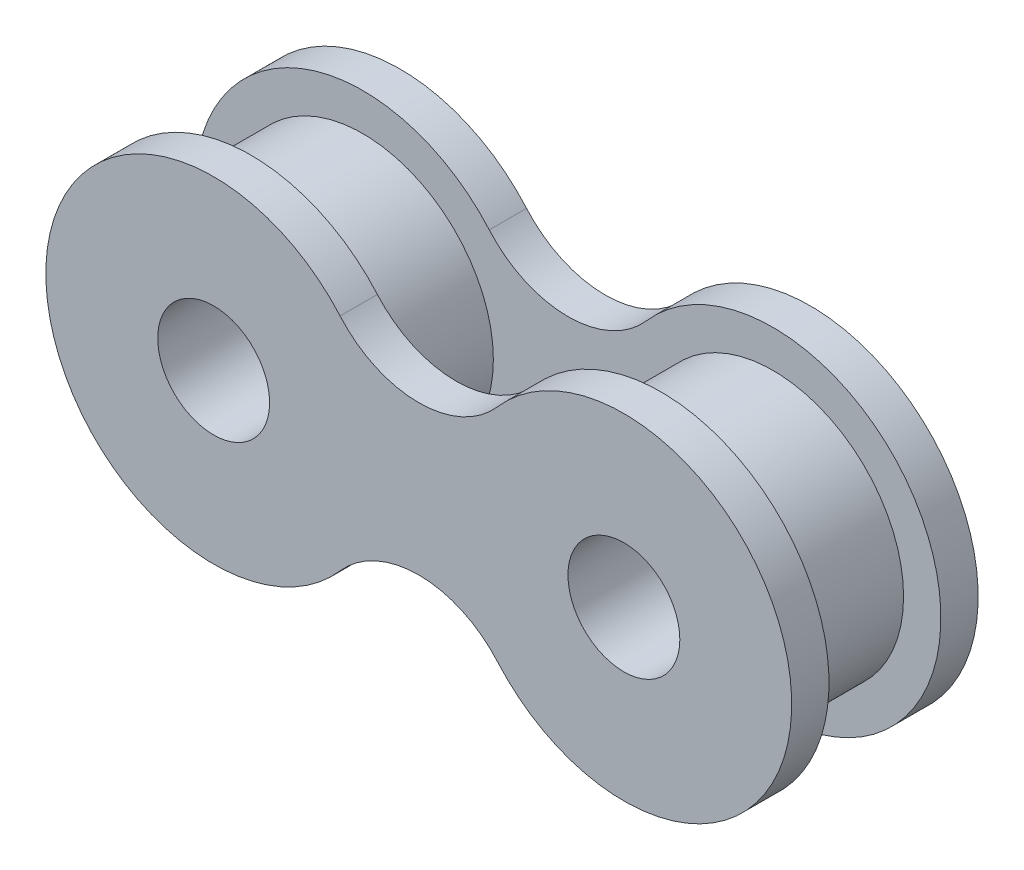
ISO-10303-21;
HEADER;
FILE_DESCRIPTION(('STEP AP214'),'2;1');
FILE_NAME('part.step','',(''),(''),'','','');
FILE_SCHEMA(('AUTOMOTIVE_DESIGN { 1 0 10303 214 1 1 1 1 }'));
ENDSEC;
DATA;
#1=APPLICATION_CONTEXT('core data for automotive mechanical design processes');
#2=APPLICATION_PROTOCOL_DEFINITION('international standard','automotive_design',2000,#1);
#3=PRODUCT_CONTEXT('',#1,'mechanical');
#4=PRODUCT('Part','Part','',(#3));
#5=PRODUCT_RELATED_PRODUCT_CATEGORY('part','',(#4));
#6=PRODUCT_DEFINITION_FORMATION('','',#4);
#7=PRODUCT_DEFINITION_CONTEXT('part definition',#1,'design');
#8=PRODUCT_DEFINITION('design','',#6,#7);
#9=PRODUCT_DEFINITION_SHAPE('','',#8);
#10=(LENGTH_UNIT() NAMED_UNIT(*) SI_UNIT(.MILLI.,.METRE.));
#11=(NAMED_UNIT(*) PLANE_ANGLE_UNIT() SI_UNIT($,.RADIAN.));
#12=(NAMED_UNIT(*) SI_UNIT($,.STERADIAN.) SOLID_ANGLE_UNIT());
#13=UNCERTAINTY_MEASURE_WITH_UNIT(LENGTH_MEASURE(1.E-05),#10,'distance_accuracy_value','');
#14=(GEOMETRIC_REPRESENTATION_CONTEXT(3) GLOBAL_UNCERTAINTY_ASSIGNED_CONTEXT((#13)) GLOBAL_UNIT_ASSIGNED_CONTEXT((#10,
#11,#12)) REPRESENTATION_CONTEXT('',''));
#15=CARTESIAN_POINT('',(0.,0.,0.));
#16=DIRECTION('',(0.,0.,1.));
#17=DIRECTION('',(1.,0.,0.));
#18=AXIS2_PLACEMENT_3D('',#15,#16,#17);
#19=CARTESIAN_POINT('',(2.75,2.4,1.));
#20=DIRECTION('',(0.,0.,1.));
#21=DIRECTION('',(1.,0.,0.));
#22=AXIS2_PLACEMENT_3D('',#19,#20,#21);
#23=PLANE('',#22);
#24=CARTESIAN_POINT('',(0.,4.8,1.));
#25=DIRECTION('',(0.,0.,-1.));
#26=DIRECTION('',(1.,0.,0.));
#27=AXIS2_PLACEMENT_3D('',#24,#25,#26);
#28=CIRCLE('',#27,2.8);
#29=CARTESIAN_POINT('',(2.10958904109589,2.95890410958904,1.));
#30=VERTEX_POINT('',#29);
#31=CARTESIAN_POINT('',(-2.10958904109589,2.95890410958904,1.));
#32=VERTEX_POINT('',#31);
#33=EDGE_CURVE('E175',#30,#32,#28,.T.);
#34=ORIENTED_EDGE('',*,*,#33,.T.);
#35=CARTESIAN_POINT('',(-5.5,0.,1.));
#36=DIRECTION('',(0.,0.,1.));
#37=DIRECTION('',(-1.,0.,0.));
#38=AXIS2_PLACEMENT_3D('',#35,#36,#37);
#39=CIRCLE('',#38,4.5);
#40=CARTESIAN_POINT('',(-2.10958904109589,-2.95890410958904,1.));
#41=VERTEX_POINT('',#40);
#42=EDGE_CURVE('E92',#32,#41,#39,.T.);
#43=ORIENTED_EDGE('',*,*,#42,.T.);
#44=CARTESIAN_POINT('',(0.,-4.8,1.));
#45=DIRECTION('',(0.,0.,-1.));
#46=DIRECTION('',(-1.,0.,0.));
#47=AXIS2_PLACEMENT_3D('',#44,#45,#46);
#48=CIRCLE('',#47,2.8);
#49=CARTESIAN_POINT('',(2.10958904109589,-2.95890410958904,1.));
#50=VERTEX_POINT('',#49);
#51=EDGE_CURVE('E180',#41,#50,#48,.T.);
#52=ORIENTED_EDGE('',*,*,#51,.T.);
#53=CARTESIAN_POINT('',(5.5,0.,1.));
#54=DIRECTION('',(0.,0.,1.));
#55=DIRECTION('',(1.,0.,0.));
#56=AXIS2_PLACEMENT_3D('',#53,#54,#55);
#57=CIRCLE('',#56,4.5);
#58=EDGE_CURVE('E60',#50,#30,#57,.T.);
#59=ORIENTED_EDGE('',*,*,#58,.T.);
#60=EDGE_LOOP('',(#34,#43,#52,#59));
#61=FACE_BOUND('',#60,.T.);
#62=CARTESIAN_POINT('',(-5.5,0.,1.));
#63=DIRECTION('',(0.,0.,1.));
#64=DIRECTION('',(1.,0.,0.));
#65=AXIS2_PLACEMENT_3D('',#62,#63,#64);
#66=CIRCLE('',#65,3.5);
#67=CARTESIAN_POINT('',(-2.,0.,1.));
#68=VERTEX_POINT('',#67);
#69=EDGE_CURVE('E11',#68,#68,#66,.T.);
#70=ORIENTED_EDGE('',*,*,#69,.F.);
#71=EDGE_LOOP('',(#70));
#72=FACE_BOUND('',#71,.T.);
#73=CARTESIAN_POINT('',(5.5,0.,1.));
#74=DIRECTION('',(0.,0.,1.));
#75=DIRECTION('',(1.,0.,0.));
#76=AXIS2_PLACEMENT_3D('',#73,#74,#75);
#77=CIRCLE('',#76,3.5);
#78=CARTESIAN_POINT('',(9.,0.,1.));
#79=VERTEX_POINT('',#78);
#80=EDGE_CURVE('E148',#79,#79,#77,.T.);
#81=ORIENTED_EDGE('',*,*,#80,.F.);
#82=EDGE_LOOP('',(#81));
#83=FACE_BOUND('',#82,.T.);
#84=ADVANCED_FACE('F41',(#61,#72,#83),#23,.T.);
#85=CARTESIAN_POINT('',(2.75,2.4,0.));
#86=DIRECTION('',(0.,0.,1.));
#87=DIRECTION('',(1.,0.,0.));
#88=AXIS2_PLACEMENT_3D('',#85,#86,#87);
#89=PLANE('',#88);
#90=CARTESIAN_POINT('',(0.,4.8,0.));
#91=DIRECTION('',(0.,0.,-1.));
#92=DIRECTION('',(1.,0.,0.));
#93=AXIS2_PLACEMENT_3D('',#90,#91,#92);
#94=CIRCLE('',#93,2.8);
#95=CARTESIAN_POINT('',(2.10958904109589,2.95890410958904,0.));
#96=VERTEX_POINT('',#95);
#97=CARTESIAN_POINT('',(-2.10958904109589,2.95890410958904,0.));
#98=VERTEX_POINT('',#97);
#99=EDGE_CURVE('E174',#96,#98,#94,.T.);
#100=ORIENTED_EDGE('',*,*,#99,.F.);
#101=CARTESIAN_POINT('',(5.5,0.,0.));
#102=DIRECTION('',(0.,0.,1.));
#103=DIRECTION('',(1.,0.,0.));
#104=AXIS2_PLACEMENT_3D('',#101,#102,#103);
#105=CIRCLE('',#104,4.5);
#106=CARTESIAN_POINT('',(2.10958904109589,-2.95890410958904,0.));
#107=VERTEX_POINT('',#106);
#108=EDGE_CURVE('E84',#107,#96,#105,.T.);
#109=ORIENTED_EDGE('',*,*,#108,.F.);
#110=CARTESIAN_POINT('',(0.,-4.8,0.));
#111=DIRECTION('',(0.,0.,-1.));
#112=DIRECTION('',(-1.,0.,0.));
#113=AXIS2_PLACEMENT_3D('',#110,#111,#112);
#114=CIRCLE('',#113,2.8);
#115=CARTESIAN_POINT('',(-2.10958904109589,-2.95890410958904,0.));
#116=VERTEX_POINT('',#115);
#117=EDGE_CURVE('E78',#116,#107,#114,.T.);
#118=ORIENTED_EDGE('',*,*,#117,.F.);
#119=CARTESIAN_POINT('',(-5.5,0.,0.));
#120=DIRECTION('',(0.,0.,1.));
#121=DIRECTION('',(-1.,0.,0.));
#122=AXIS2_PLACEMENT_3D('',#119,#120,#121);
#123=CIRCLE('',#122,4.5);
#124=EDGE_CURVE('E189',#98,#116,#123,.T.);
#125=ORIENTED_EDGE('',*,*,#124,.F.);
#126=EDGE_LOOP('',(#100,#109,#118,#125));
#127=FACE_BOUND('',#126,.T.);
#128=CARTESIAN_POINT('',(-5.5,0.,0.));
#129=DIRECTION('',(0.,0.,1.));
#130=DIRECTION('',(1.,0.,0.));
#131=AXIS2_PLACEMENT_3D('',#128,#129,#130);
#132=CIRCLE('',#131,1.5);
#133=CARTESIAN_POINT('',(-4.,0.,0.));
#134=VERTEX_POINT('',#133);
#135=EDGE_CURVE('E170',#134,#134,#132,.T.);
#136=ORIENTED_EDGE('',*,*,#135,.T.);
#137=EDGE_LOOP('',(#136));
#138=FACE_BOUND('',#137,.T.);
#139=CARTESIAN_POINT('',(5.5,0.,0.));
#140=DIRECTION('',(0.,0.,1.));
#141=DIRECTION('',(-1.,0.,0.));
#142=AXIS2_PLACEMENT_3D('',#139,#140,#141);
#143=CIRCLE('',#142,1.5);
#144=CARTESIAN_POINT('',(4.,0.,0.));
#145=VERTEX_POINT('',#144);
#146=EDGE_CURVE('E165',#145,#145,#143,.T.);
#147=ORIENTED_EDGE('',*,*,#146,.T.);
#148=EDGE_LOOP('',(#147));
#149=FACE_BOUND('',#148,.T.);
#150=ADVANCED_FACE('F210',(#127,#138,#149),#89,.F.);
#151=CARTESIAN_POINT('',(0.,4.8,1.));
#152=DIRECTION('',(0.,0.,-1.));
#153=DIRECTION('',(-1.,0.,0.));
#154=AXIS2_PLACEMENT_3D('',#151,#152,#153);
#155=CYLINDRICAL_SURFACE('',#154,2.8);
#156=ORIENTED_EDGE('',*,*,#99,.T.);
#157=DIRECTION('',(0.,0.,-1.));
#158=VECTOR('',#157,1.);
#159=CARTESIAN_POINT('',(-2.10958904109589,2.95890410958904,1.));
#160=LINE('',#159,#158);
#161=EDGE_CURVE('E45',#32,#98,#160,.T.);
#162=ORIENTED_EDGE('',*,*,#161,.F.);
#163=ORIENTED_EDGE('',*,*,#33,.F.);
#164=DIRECTION('',(0.,0.,-1.));
#165=VECTOR('',#164,1.);
#166=CARTESIAN_POINT('',(2.10958904109589,2.95890410958904,1.));
#167=LINE('',#166,#165);
#168=EDGE_CURVE('E185',#30,#96,#167,.T.);
#169=ORIENTED_EDGE('',*,*,#168,.T.);
#170=EDGE_LOOP('',(#156,#162,#163,#169));
#171=FACE_BOUND('',#170,.T.);
#172=ADVANCED_FACE('F43',(#171),#155,.F.);
#173=CARTESIAN_POINT('',(-5.5,0.,1.));
#174=DIRECTION('',(0.,0.,-1.));
#175=DIRECTION('',(-1.,0.,0.));
#176=AXIS2_PLACEMENT_3D('',#173,#174,#175);
#177=CYLINDRICAL_SURFACE('',#176,4.5);
#178=ORIENTED_EDGE('',*,*,#124,.T.);
#179=DIRECTION('',(0.,0.,-1.));
#180=VECTOR('',#179,1.);
#181=CARTESIAN_POINT('',(-2.10958904109589,-2.95890410958904,1.));
#182=LINE('',#181,#180);
#183=EDGE_CURVE('E200',#41,#116,#182,.T.);
#184=ORIENTED_EDGE('',*,*,#183,.F.);
#185=ORIENTED_EDGE('',*,*,#42,.F.);
#186=ORIENTED_EDGE('',*,*,#161,.T.);
#187=EDGE_LOOP('',(#178,#184,#185,#186));
#188=FACE_BOUND('',#187,.T.);
#189=ADVANCED_FACE('F205',(#188),#177,.T.);
#190=CARTESIAN_POINT('',(0.,-4.8,1.));
#191=DIRECTION('',(0.,0.,-1.));
#192=DIRECTION('',(-1.,0.,0.));
#193=AXIS2_PLACEMENT_3D('',#190,#191,#192);
#194=CYLINDRICAL_SURFACE('',#193,2.8);
#195=ORIENTED_EDGE('',*,*,#117,.T.);
#196=DIRECTION('',(0.,0.,-1.));
#197=VECTOR('',#196,1.);
#198=CARTESIAN_POINT('',(2.10958904109589,-2.95890410958904,1.));
#199=LINE('',#198,#197);
#200=EDGE_CURVE('E198',#50,#107,#199,.T.);
#201=ORIENTED_EDGE('',*,*,#200,.F.);
#202=ORIENTED_EDGE('',*,*,#51,.F.);
#203=ORIENTED_EDGE('',*,*,#183,.T.);
#204=EDGE_LOOP('',(#195,#201,#202,#203));
#205=FACE_BOUND('',#204,.T.);
#206=ADVANCED_FACE('F279',(#205),#194,.F.);
#207=CARTESIAN_POINT('',(5.5,0.,1.));
#208=DIRECTION('',(0.,0.,-1.));
#209=DIRECTION('',(-1.,0.,0.));
#210=AXIS2_PLACEMENT_3D('',#207,#208,#209);
#211=CYLINDRICAL_SURFACE('',#210,4.5);
#212=ORIENTED_EDGE('',*,*,#108,.T.);
#213=ORIENTED_EDGE('',*,*,#168,.F.);
#214=ORIENTED_EDGE('',*,*,#58,.F.);
#215=ORIENTED_EDGE('',*,*,#200,.T.);
#216=EDGE_LOOP('',(#212,#213,#214,#215));
#217=FACE_BOUND('',#216,.T.);
#218=ADVANCED_FACE('F276',(#217),#211,.T.);
#219=CARTESIAN_POINT('',(-5.5,0.,1.));
#220=DIRECTION('',(0.,0.,-1.));
#221=DIRECTION('',(-1.,0.,0.));
#222=AXIS2_PLACEMENT_3D('',#219,#220,#221);
#223=CYLINDRICAL_SURFACE('',#222,1.5);
#224=ORIENTED_EDGE('',*,*,#135,.F.);
#225=EDGE_LOOP('',(#224));
#226=FACE_BOUND('',#225,.T.);
#227=CARTESIAN_POINT('',(-5.5,0.,5.));
#228=DIRECTION('',(0.,0.,1.));
#229=DIRECTION('',(1.,0.,0.));
#230=AXIS2_PLACEMENT_3D('',#227,#228,#229);
#231=CIRCLE('',#230,1.5);
#232=CARTESIAN_POINT('',(-4.,0.,5.));
#233=VERTEX_POINT('',#232);
#234=EDGE_CURVE('E228',#233,#233,#231,.T.);
#235=ORIENTED_EDGE('',*,*,#234,.T.);
#236=EDGE_LOOP('',(#235));
#237=FACE_BOUND('',#236,.T.);
#238=ADVANCED_FACE('F222',(#226,#237),#223,.F.);
#239=CARTESIAN_POINT('',(5.5,0.,1.));
#240=DIRECTION('',(0.,0.,-1.));
#241=DIRECTION('',(-1.,0.,0.));
#242=AXIS2_PLACEMENT_3D('',#239,#240,#241);
#243=CYLINDRICAL_SURFACE('',#242,1.5);
#244=ORIENTED_EDGE('',*,*,#146,.F.);
#245=EDGE_LOOP('',(#244));
#246=FACE_BOUND('',#245,.T.);
#247=CARTESIAN_POINT('',(5.5,0.,5.));
#248=DIRECTION('',(0.,0.,1.));
#249=DIRECTION('',(1.,0.,0.));
#250=AXIS2_PLACEMENT_3D('',#247,#248,#249);
#251=CIRCLE('',#250,1.5);
#252=CARTESIAN_POINT('',(7.,0.,5.));
#253=VERTEX_POINT('',#252);
#254=EDGE_CURVE('E226',#253,#253,#251,.T.);
#255=ORIENTED_EDGE('',*,*,#254,.T.);
#256=EDGE_LOOP('',(#255));
#257=FACE_BOUND('',#256,.T.);
#258=ADVANCED_FACE('F218',(#246,#257),#243,.F.);
#259=CARTESIAN_POINT('',(-5.5,0.,4.));
#260=DIRECTION('',(0.,0.,-1.));
#261=DIRECTION('',(-1.,0.,0.));
#262=AXIS2_PLACEMENT_3D('',#259,#260,#261);
#263=CYLINDRICAL_SURFACE('',#262,3.5);
#264=CARTESIAN_POINT('',(-5.5,0.,4.));
#265=DIRECTION('',(0.,0.,1.));
#266=DIRECTION('',(1.,0.,0.));
#267=AXIS2_PLACEMENT_3D('',#264,#265,#266);
#268=CIRCLE('',#267,3.5);
#269=CARTESIAN_POINT('',(-2.,0.,4.));
#270=VERTEX_POINT('',#269);
#271=EDGE_CURVE('E161',#270,#270,#268,.T.);
#272=ORIENTED_EDGE('',*,*,#271,.F.);
#273=EDGE_LOOP('',(#272));
#274=FACE_BOUND('',#273,.T.);
#275=ORIENTED_EDGE('',*,*,#69,.T.);
#276=EDGE_LOOP('',(#275));
#277=FACE_BOUND('',#276,.T.);
#278=ADVANCED_FACE('F221',(#274,#277),#263,.T.);
#279=CARTESIAN_POINT('',(5.5,0.,4.));
#280=DIRECTION('',(0.,0.,-1.));
#281=DIRECTION('',(-1.,0.,0.));
#282=AXIS2_PLACEMENT_3D('',#279,#280,#281);
#283=CYLINDRICAL_SURFACE('',#282,3.5);
#284=CARTESIAN_POINT('',(5.5,0.,4.));
#285=DIRECTION('',(0.,0.,1.));
#286=DIRECTION('',(1.,0.,0.));
#287=AXIS2_PLACEMENT_3D('',#284,#285,#286);
#288=CIRCLE('',#287,3.5);
#289=CARTESIAN_POINT('',(9.,0.,4.));
#290=VERTEX_POINT('',#289);
#291=EDGE_CURVE('E153',#290,#290,#288,.T.);
#292=ORIENTED_EDGE('',*,*,#291,.F.);
#293=EDGE_LOOP('',(#292));
#294=FACE_BOUND('',#293,.T.);
#295=ORIENTED_EDGE('',*,*,#80,.T.);
#296=EDGE_LOOP('',(#295));
#297=FACE_BOUND('',#296,.T.);
#298=ADVANCED_FACE('F336',(#294,#297),#283,.T.);
#299=CARTESIAN_POINT('',(-2.75,-2.4,5.));
#300=DIRECTION('',(0.,0.,1.));
#301=DIRECTION('',(1.,0.,0.));
#302=AXIS2_PLACEMENT_3D('',#299,#300,#301);
#303=PLANE('',#302);
#304=ORIENTED_EDGE('',*,*,#234,.F.);
#305=EDGE_LOOP('',(#304));
#306=FACE_BOUND('',#305,.T.);
#307=CARTESIAN_POINT('',(-5.5,0.,5.));
#308=DIRECTION('',(0.,0.,1.));
#309=DIRECTION('',(1.,0.,0.));
#310=AXIS2_PLACEMENT_3D('',#307,#308,#309);
#311=CIRCLE('',#310,4.5);
#312=CARTESIAN_POINT('',(-2.10958904109589,2.95890410958904,5.));
#313=VERTEX_POINT('',#312);
#314=CARTESIAN_POINT('',(-2.10958904109589,-2.95890410958904,5.));
#315=VERTEX_POINT('',#314);
#316=EDGE_CURVE('E131',#313,#315,#311,.T.);
#317=ORIENTED_EDGE('',*,*,#316,.T.);
#318=CARTESIAN_POINT('',(0.,-4.8,5.));
#319=DIRECTION('',(0.,0.,-1.));
#320=DIRECTION('',(1.,0.,0.));
#321=AXIS2_PLACEMENT_3D('',#318,#319,#320);
#322=CIRCLE('',#321,2.8);
#323=CARTESIAN_POINT('',(2.10958904109589,-2.95890410958904,5.));
#324=VERTEX_POINT('',#323);
#325=EDGE_CURVE('E119',#315,#324,#322,.T.);
#326=ORIENTED_EDGE('',*,*,#325,.T.);
#327=CARTESIAN_POINT('',(5.5,0.,5.));
#328=DIRECTION('',(0.,0.,1.));
#329=DIRECTION('',(1.,0.,0.));
#330=AXIS2_PLACEMENT_3D('',#327,#328,#329);
#331=CIRCLE('',#330,4.5);
#332=CARTESIAN_POINT('',(2.10958904109589,2.95890410958904,5.));
#333=VERTEX_POINT('',#332);
#334=EDGE_CURVE('E130',#324,#333,#331,.T.);
#335=ORIENTED_EDGE('',*,*,#334,.T.);
#336=CARTESIAN_POINT('',(0.,4.8,5.));
#337=DIRECTION('',(0.,0.,-1.));
#338=DIRECTION('',(1.,0.,0.));
#339=AXIS2_PLACEMENT_3D('',#336,#337,#338);
#340=CIRCLE('',#339,2.8);
#341=EDGE_CURVE('E137',#333,#313,#340,.T.);
#342=ORIENTED_EDGE('',*,*,#341,.T.);
#343=EDGE_LOOP('',(#317,#326,#335,#342));
#344=FACE_BOUND('',#343,.T.);
#345=ORIENTED_EDGE('',*,*,#254,.F.);
#346=EDGE_LOOP('',(#345));
#347=FACE_BOUND('',#346,.T.);
#348=ADVANCED_FACE('F134',(#306,#344,#347),#303,.T.);
#349=CARTESIAN_POINT('',(-2.75,-2.4,4.));
#350=DIRECTION('',(0.,0.,1.));
#351=DIRECTION('',(1.,0.,0.));
#352=AXIS2_PLACEMENT_3D('',#349,#350,#351);
#353=PLANE('',#352);
#354=ORIENTED_EDGE('',*,*,#271,.T.);
#355=EDGE_LOOP('',(#354));
#356=FACE_BOUND('',#355,.T.);
#357=ORIENTED_EDGE('',*,*,#291,.T.);
#358=EDGE_LOOP('',(#357));
#359=FACE_BOUND('',#358,.T.);
#360=CARTESIAN_POINT('',(-5.5,0.,4.));
#361=DIRECTION('',(0.,0.,1.));
#362=DIRECTION('',(1.,0.,0.));
#363=AXIS2_PLACEMENT_3D('',#360,#361,#362);
#364=CIRCLE('',#363,4.5);
#365=CARTESIAN_POINT('',(-2.10958904109589,2.95890410958904,4.));
#366=VERTEX_POINT('',#365);
#367=CARTESIAN_POINT('',(-2.10958904109589,-2.95890410958904,4.));
#368=VERTEX_POINT('',#367);
#369=EDGE_CURVE('E146',#366,#368,#364,.T.);
#370=ORIENTED_EDGE('',*,*,#369,.F.);
#371=CARTESIAN_POINT('',(0.,4.8,4.));
#372=DIRECTION('',(0.,0.,-1.));
#373=DIRECTION('',(1.,0.,0.));
#374=AXIS2_PLACEMENT_3D('',#371,#372,#373);
#375=CIRCLE('',#374,2.8);
#376=CARTESIAN_POINT('',(2.10958904109589,2.95890410958904,4.));
#377=VERTEX_POINT('',#376);
#378=EDGE_CURVE('E142',#377,#366,#375,.T.);
#379=ORIENTED_EDGE('',*,*,#378,.F.);
#380=CARTESIAN_POINT('',(5.5,0.,4.));
#381=DIRECTION('',(0.,0.,1.));
#382=DIRECTION('',(1.,0.,0.));
#383=AXIS2_PLACEMENT_3D('',#380,#381,#382);
#384=CIRCLE('',#383,4.5);
#385=CARTESIAN_POINT('',(2.10958904109589,-2.95890410958904,4.));
#386=VERTEX_POINT('',#385);
#387=EDGE_CURVE('E244',#386,#377,#384,.T.);
#388=ORIENTED_EDGE('',*,*,#387,.F.);
#389=CARTESIAN_POINT('',(0.,-4.8,4.));
#390=DIRECTION('',(0.,0.,-1.));
#391=DIRECTION('',(1.,0.,0.));
#392=AXIS2_PLACEMENT_3D('',#389,#390,#391);
#393=CIRCLE('',#392,2.8);
#394=EDGE_CURVE('E241',#368,#386,#393,.T.);
#395=ORIENTED_EDGE('',*,*,#394,.F.);
#396=EDGE_LOOP('',(#370,#379,#388,#395));
#397=FACE_BOUND('',#396,.T.);
#398=ADVANCED_FACE('F259',(#356,#359,#397),#353,.F.);
#399=CARTESIAN_POINT('',(-5.5,0.,5.));
#400=DIRECTION('',(0.,0.,-1.));
#401=DIRECTION('',(-1.,0.,0.));
#402=AXIS2_PLACEMENT_3D('',#399,#400,#401);
#403=CYLINDRICAL_SURFACE('',#402,4.5);
#404=ORIENTED_EDGE('',*,*,#369,.T.);
#405=DIRECTION('',(0.,0.,-1.));
#406=VECTOR('',#405,1.);
#407=CARTESIAN_POINT('',(-2.10958904109589,-2.95890410958904,5.));
#408=LINE('',#407,#406);
#409=EDGE_CURVE('E123',#315,#368,#408,.T.);
#410=ORIENTED_EDGE('',*,*,#409,.F.);
#411=ORIENTED_EDGE('',*,*,#316,.F.);
#412=DIRECTION('',(0.,0.,-1.));
#413=VECTOR('',#412,1.);
#414=CARTESIAN_POINT('',(-2.10958904109589,2.95890410958904,5.));
#415=LINE('',#414,#413);
#416=EDGE_CURVE('E238',#313,#366,#415,.T.);
#417=ORIENTED_EDGE('',*,*,#416,.T.);
#418=EDGE_LOOP('',(#404,#410,#411,#417));
#419=FACE_BOUND('',#418,.T.);
#420=ADVANCED_FACE('F144',(#419),#403,.T.);
#421=CARTESIAN_POINT('',(0.,-4.8,5.));
#422=DIRECTION('',(0.,0.,-1.));
#423=DIRECTION('',(-1.,0.,0.));
#424=AXIS2_PLACEMENT_3D('',#421,#422,#423);
#425=CYLINDRICAL_SURFACE('',#424,2.8);
#426=ORIENTED_EDGE('',*,*,#394,.T.);
#427=DIRECTION('',(0.,0.,-1.));
#428=VECTOR('',#427,1.);
#429=CARTESIAN_POINT('',(2.10958904109589,-2.95890410958904,5.));
#430=LINE('',#429,#428);
#431=EDGE_CURVE('E126',#324,#386,#430,.T.);
#432=ORIENTED_EDGE('',*,*,#431,.F.);
#433=ORIENTED_EDGE('',*,*,#325,.F.);
#434=ORIENTED_EDGE('',*,*,#409,.T.);
#435=EDGE_LOOP('',(#426,#432,#433,#434));
#436=FACE_BOUND('',#435,.T.);
#437=ADVANCED_FACE('F121',(#436),#425,.F.);
#438=CARTESIAN_POINT('',(5.5,0.,5.));
#439=DIRECTION('',(0.,0.,-1.));
#440=DIRECTION('',(-1.,0.,0.));
#441=AXIS2_PLACEMENT_3D('',#438,#439,#440);
#442=CYLINDRICAL_SURFACE('',#441,4.5);
#443=ORIENTED_EDGE('',*,*,#387,.T.);
#444=DIRECTION('',(0.,0.,-1.));
#445=VECTOR('',#444,1.);
#446=CARTESIAN_POINT('',(2.10958904109589,2.95890410958904,5.));
#447=LINE('',#446,#445);
#448=EDGE_CURVE('E155',#333,#377,#447,.T.);
#449=ORIENTED_EDGE('',*,*,#448,.F.);
#450=ORIENTED_EDGE('',*,*,#334,.F.);
#451=ORIENTED_EDGE('',*,*,#431,.T.);
#452=EDGE_LOOP('',(#443,#449,#450,#451));
#453=FACE_BOUND('',#452,.T.);
#454=ADVANCED_FACE('F260',(#453),#442,.T.);
#455=CARTESIAN_POINT('',(0.,4.8,5.));
#456=DIRECTION('',(0.,0.,-1.));
#457=DIRECTION('',(-1.,0.,0.));
#458=AXIS2_PLACEMENT_3D('',#455,#456,#457);
#459=CYLINDRICAL_SURFACE('',#458,2.8);
#460=ORIENTED_EDGE('',*,*,#378,.T.);
#461=ORIENTED_EDGE('',*,*,#416,.F.);
#462=ORIENTED_EDGE('',*,*,#341,.F.);
#463=ORIENTED_EDGE('',*,*,#448,.T.);
#464=EDGE_LOOP('',(#460,#461,#462,#463));
#465=FACE_BOUND('',#464,.T.);
#466=ADVANCED_FACE('F255',(#465),#459,.F.);
#467=CLOSED_SHELL('',(#84,#150,#172,#189,#206,#218,#238,#258,#278,#298,#348,#398,#420,#437,#454,#466));
#468=MANIFOLD_SOLID_BREP('B2',#467);
#469=ADVANCED_BREP_SHAPE_REPRESENTATION('',(#18,#468),#14);
#470=SHAPE_DEFINITION_REPRESENTATION(#9,#469);
ENDSEC;
END-ISO-10303-21;
